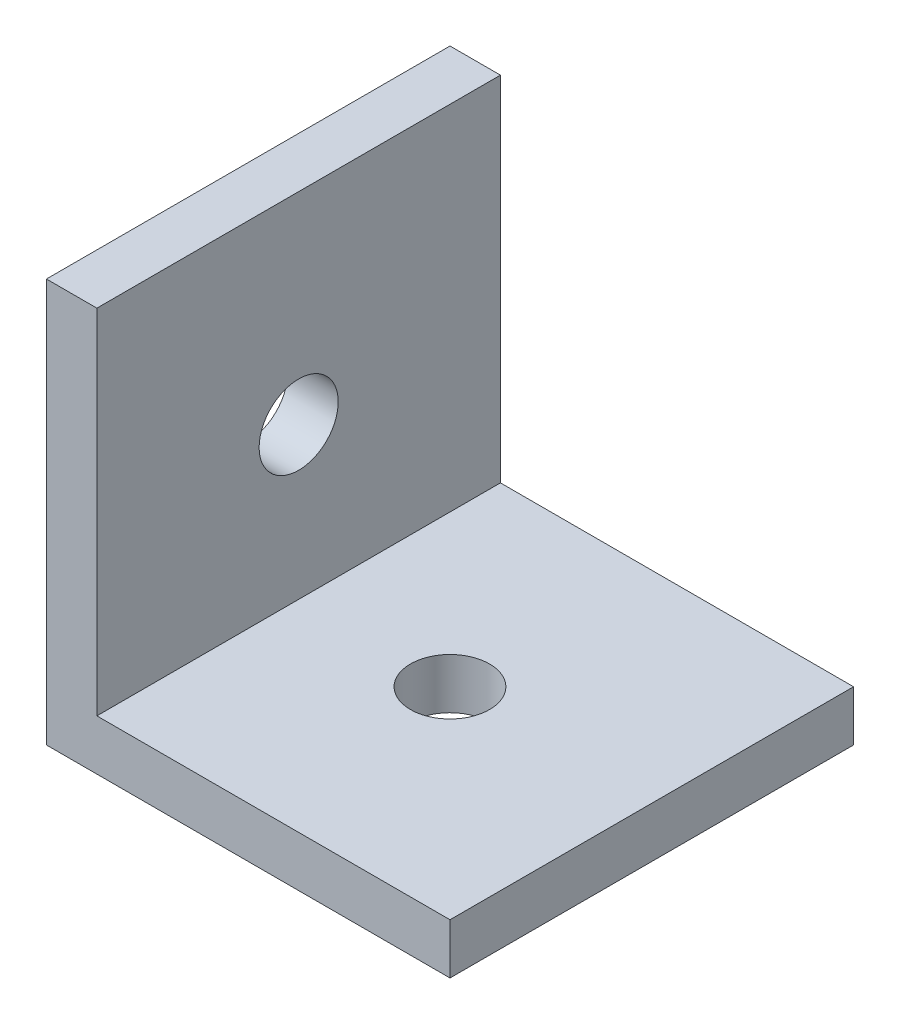
ISO-10303-21;
HEADER;
FILE_DESCRIPTION(('STEP AP214'),'2;1');
FILE_NAME('part.step','',(''),(''),'','','');
FILE_SCHEMA(('AUTOMOTIVE_DESIGN { 1 0 10303 214 1 1 1 1 }'));
ENDSEC;
DATA;
#1=APPLICATION_CONTEXT('core data for automotive mechanical design processes');
#2=APPLICATION_PROTOCOL_DEFINITION('international standard','automotive_design',2000,#1);
#3=PRODUCT_CONTEXT('',#1,'mechanical');
#4=PRODUCT('Part','Part','',(#3));
#5=PRODUCT_RELATED_PRODUCT_CATEGORY('part','',(#4));
#6=PRODUCT_DEFINITION_FORMATION('','',#4);
#7=PRODUCT_DEFINITION_CONTEXT('part definition',#1,'design');
#8=PRODUCT_DEFINITION('design','',#6,#7);
#9=PRODUCT_DEFINITION_SHAPE('','',#8);
#10=(LENGTH_UNIT() NAMED_UNIT(*) SI_UNIT(.MILLI.,.METRE.));
#11=(NAMED_UNIT(*) PLANE_ANGLE_UNIT() SI_UNIT($,.RADIAN.));
#12=(NAMED_UNIT(*) SI_UNIT($,.STERADIAN.) SOLID_ANGLE_UNIT());
#13=UNCERTAINTY_MEASURE_WITH_UNIT(LENGTH_MEASURE(1.E-05),#10,'distance_accuracy_value','');
#14=(GEOMETRIC_REPRESENTATION_CONTEXT(3) GLOBAL_UNCERTAINTY_ASSIGNED_CONTEXT((#13)) GLOBAL_UNIT_ASSIGNED_CONTEXT((#10,
#11,#12)) REPRESENTATION_CONTEXT('',''));
#15=CARTESIAN_POINT('',(0.,0.,0.));
#16=DIRECTION('',(0.,0.,1.));
#17=DIRECTION('',(1.,0.,0.));
#18=AXIS2_PLACEMENT_3D('',#15,#16,#17);
#19=CARTESIAN_POINT('',(0.,0.,12.7));
#20=DIRECTION('',(0.,1.,0.));
#21=DIRECTION('',(0.,0.,1.));
#22=AXIS2_PLACEMENT_3D('',#19,#20,#21);
#23=PLANE('',#22);
#24=CARTESIAN_POINT('',(12.7,0.,0.));
#25=DIRECTION('',(0.,1.,0.));
#26=DIRECTION('',(0.,0.,1.));
#27=AXIS2_PLACEMENT_3D('',#24,#25,#26);
#28=CIRCLE('',#27,2.4892);
#29=CARTESIAN_POINT('',(12.7,0.,2.4892));
#30=VERTEX_POINT('',#29);
#31=EDGE_CURVE('E130',#30,#30,#28,.T.);
#32=ORIENTED_EDGE('',*,*,#31,.T.);
#33=EDGE_LOOP('',(#32));
#34=FACE_BOUND('',#33,.T.);
#35=DIRECTION('',(1.,0.,0.));
#36=VECTOR('',#35,1.);
#37=CARTESIAN_POINT('',(0.,0.,-12.7));
#38=LINE('',#37,#36);
#39=CARTESIAN_POINT('',(0.,0.,-12.7));
#40=VERTEX_POINT('',#39);
#41=CARTESIAN_POINT('',(25.4,0.,-12.7));
#42=VERTEX_POINT('',#41);
#43=EDGE_CURVE('E125',#40,#42,#38,.T.);
#44=ORIENTED_EDGE('',*,*,#43,.T.);
#45=DIRECTION('',(0.,0.,-1.));
#46=VECTOR('',#45,1.);
#47=CARTESIAN_POINT('',(25.4,0.,12.7));
#48=LINE('',#47,#46);
#49=CARTESIAN_POINT('',(25.4,0.,12.7));
#50=VERTEX_POINT('',#49);
#51=EDGE_CURVE('E11',#50,#42,#48,.T.);
#52=ORIENTED_EDGE('',*,*,#51,.F.);
#53=DIRECTION('',(1.,0.,0.));
#54=VECTOR('',#53,1.);
#55=CARTESIAN_POINT('',(0.,0.,12.7));
#56=LINE('',#55,#54);
#57=CARTESIAN_POINT('',(0.,0.,12.7));
#58=VERTEX_POINT('',#57);
#59=EDGE_CURVE('E86',#58,#50,#56,.T.);
#60=ORIENTED_EDGE('',*,*,#59,.F.);
#61=DIRECTION('',(0.,0.,-1.));
#62=VECTOR('',#61,1.);
#63=CARTESIAN_POINT('',(0.,0.,12.7));
#64=LINE('',#63,#62);
#65=EDGE_CURVE('E121',#58,#40,#64,.T.);
#66=ORIENTED_EDGE('',*,*,#65,.T.);
#67=EDGE_LOOP('',(#44,#52,#60,#66));
#68=FACE_BOUND('',#67,.T.);
#69=ADVANCED_FACE('F39',(#34,#68),#23,.F.);
#70=CARTESIAN_POINT('',(25.4,3.175,12.7));
#71=DIRECTION('',(1.,0.,0.));
#72=DIRECTION('',(0.,0.,-1.));
#73=AXIS2_PLACEMENT_3D('',#70,#71,#72);
#74=PLANE('',#73);
#75=DIRECTION('',(0.,-1.,0.));
#76=VECTOR('',#75,1.);
#77=CARTESIAN_POINT('',(25.4,3.175,-12.7));
#78=LINE('',#77,#76);
#79=CARTESIAN_POINT('',(25.4,3.175,-12.7));
#80=VERTEX_POINT('',#79);
#81=EDGE_CURVE('E129',#80,#42,#78,.T.);
#82=ORIENTED_EDGE('',*,*,#81,.F.);
#83=DIRECTION('',(0.,0.,-1.));
#84=VECTOR('',#83,1.);
#85=CARTESIAN_POINT('',(25.4,3.175,12.7));
#86=LINE('',#85,#84);
#87=CARTESIAN_POINT('',(25.4,3.175,12.7));
#88=VERTEX_POINT('',#87);
#89=EDGE_CURVE('E48',#88,#80,#86,.T.);
#90=ORIENTED_EDGE('',*,*,#89,.F.);
#91=DIRECTION('',(0.,-1.,0.));
#92=VECTOR('',#91,1.);
#93=CARTESIAN_POINT('',(25.4,3.175,12.7));
#94=LINE('',#93,#92);
#95=EDGE_CURVE('E195',#88,#50,#94,.T.);
#96=ORIENTED_EDGE('',*,*,#95,.T.);
#97=ORIENTED_EDGE('',*,*,#51,.T.);
#98=EDGE_LOOP('',(#82,#90,#96,#97));
#99=FACE_BOUND('',#98,.T.);
#100=ADVANCED_FACE('F157',(#99),#74,.T.);
#101=CARTESIAN_POINT('',(0.,3.175,12.7));
#102=DIRECTION('',(0.,1.,0.));
#103=DIRECTION('',(0.,0.,1.));
#104=AXIS2_PLACEMENT_3D('',#101,#102,#103);
#105=PLANE('',#104);
#106=CARTESIAN_POINT('',(12.7,3.175,0.));
#107=DIRECTION('',(0.,1.,0.));
#108=DIRECTION('',(0.,0.,1.));
#109=AXIS2_PLACEMENT_3D('',#106,#107,#108);
#110=CIRCLE('',#109,2.4892);
#111=CARTESIAN_POINT('',(12.7,3.175,2.4892));
#112=VERTEX_POINT('',#111);
#113=EDGE_CURVE('E183',#112,#112,#110,.T.);
#114=ORIENTED_EDGE('',*,*,#113,.F.);
#115=EDGE_LOOP('',(#114));
#116=FACE_BOUND('',#115,.T.);
#117=DIRECTION('',(1.,0.,0.));
#118=VECTOR('',#117,1.);
#119=CARTESIAN_POINT('',(0.,3.175,-12.7));
#120=LINE('',#119,#118);
#121=CARTESIAN_POINT('',(3.175,3.175,-12.7));
#122=VERTEX_POINT('',#121);
#123=EDGE_CURVE('E134',#122,#80,#120,.T.);
#124=ORIENTED_EDGE('',*,*,#123,.F.);
#125=DIRECTION('',(0.,0.,-1.));
#126=VECTOR('',#125,1.);
#127=CARTESIAN_POINT('',(3.175,3.175,12.7));
#128=LINE('',#127,#126);
#129=CARTESIAN_POINT('',(3.175,3.175,12.7));
#130=VERTEX_POINT('',#129);
#131=EDGE_CURVE('E108',#130,#122,#128,.T.);
#132=ORIENTED_EDGE('',*,*,#131,.F.);
#133=DIRECTION('',(1.,0.,0.));
#134=VECTOR('',#133,1.);
#135=CARTESIAN_POINT('',(0.,3.175,12.7));
#136=LINE('',#135,#134);
#137=EDGE_CURVE('E114',#130,#88,#136,.T.);
#138=ORIENTED_EDGE('',*,*,#137,.T.);
#139=ORIENTED_EDGE('',*,*,#89,.T.);
#140=EDGE_LOOP('',(#124,#132,#138,#139));
#141=FACE_BOUND('',#140,.T.);
#142=ADVANCED_FACE('F154',(#116,#141),#105,.T.);
#143=CARTESIAN_POINT('',(3.175,25.4,12.7));
#144=DIRECTION('',(1.,0.,0.));
#145=DIRECTION('',(0.,0.,-1.));
#146=AXIS2_PLACEMENT_3D('',#143,#144,#145);
#147=PLANE('',#146);
#148=CARTESIAN_POINT('',(3.175,12.7,0.));
#149=DIRECTION('',(-1.,0.,0.));
#150=DIRECTION('',(0.,0.,1.));
#151=AXIS2_PLACEMENT_3D('',#148,#149,#150);
#152=CIRCLE('',#151,2.4892);
#153=CARTESIAN_POINT('',(3.175,12.7,2.4892));
#154=VERTEX_POINT('',#153);
#155=EDGE_CURVE('E190',#154,#154,#152,.T.);
#156=ORIENTED_EDGE('',*,*,#155,.T.);
#157=EDGE_LOOP('',(#156));
#158=FACE_BOUND('',#157,.T.);
#159=DIRECTION('',(0.,1.,0.));
#160=VECTOR('',#159,1.);
#161=CARTESIAN_POINT('',(3.175,25.4,-12.7));
#162=LINE('',#161,#160);
#163=CARTESIAN_POINT('',(3.175,25.4,-12.7));
#164=VERTEX_POINT('',#163);
#165=EDGE_CURVE('E102',#164,#122,#162,.F.);
#166=ORIENTED_EDGE('',*,*,#165,.F.);
#167=DIRECTION('',(0.,0.,-1.));
#168=VECTOR('',#167,1.);
#169=CARTESIAN_POINT('',(3.175,25.4,12.7));
#170=LINE('',#169,#168);
#171=CARTESIAN_POINT('',(3.175,25.4,12.7));
#172=VERTEX_POINT('',#171);
#173=EDGE_CURVE('E97',#172,#164,#170,.T.);
#174=ORIENTED_EDGE('',*,*,#173,.F.);
#175=DIRECTION('',(0.,1.,0.));
#176=VECTOR('',#175,1.);
#177=CARTESIAN_POINT('',(3.175,25.4,12.7));
#178=LINE('',#177,#176);
#179=EDGE_CURVE('E100',#172,#130,#178,.F.);
#180=ORIENTED_EDGE('',*,*,#179,.T.);
#181=ORIENTED_EDGE('',*,*,#131,.T.);
#182=EDGE_LOOP('',(#166,#174,#180,#181));
#183=FACE_BOUND('',#182,.T.);
#184=ADVANCED_FACE('F99',(#158,#183),#147,.T.);
#185=CARTESIAN_POINT('',(0.,25.4,12.7));
#186=DIRECTION('',(0.,1.,0.));
#187=DIRECTION('',(0.,0.,1.));
#188=AXIS2_PLACEMENT_3D('',#185,#186,#187);
#189=PLANE('',#188);
#190=DIRECTION('',(1.,0.,0.));
#191=VECTOR('',#190,1.);
#192=CARTESIAN_POINT('',(0.,25.4,-12.7));
#193=LINE('',#192,#191);
#194=CARTESIAN_POINT('',(0.,25.4,-12.7));
#195=VERTEX_POINT('',#194);
#196=EDGE_CURVE('E140',#195,#164,#193,.T.);
#197=ORIENTED_EDGE('',*,*,#196,.F.);
#198=DIRECTION('',(0.,0.,-1.));
#199=VECTOR('',#198,1.);
#200=CARTESIAN_POINT('',(0.,25.4,12.7));
#201=LINE('',#200,#199);
#202=CARTESIAN_POINT('',(0.,25.4,12.7));
#203=VERTEX_POINT('',#202);
#204=EDGE_CURVE('E77',#203,#195,#201,.T.);
#205=ORIENTED_EDGE('',*,*,#204,.F.);
#206=DIRECTION('',(1.,0.,0.));
#207=VECTOR('',#206,1.);
#208=CARTESIAN_POINT('',(0.,25.4,12.7));
#209=LINE('',#208,#207);
#210=EDGE_CURVE('E112',#203,#172,#209,.T.);
#211=ORIENTED_EDGE('',*,*,#210,.T.);
#212=ORIENTED_EDGE('',*,*,#173,.T.);
#213=EDGE_LOOP('',(#197,#205,#211,#212));
#214=FACE_BOUND('',#213,.T.);
#215=ADVANCED_FACE('F117',(#214),#189,.T.);
#216=CARTESIAN_POINT('',(0.,25.4,12.7));
#217=DIRECTION('',(1.,0.,0.));
#218=DIRECTION('',(0.,0.,-1.));
#219=AXIS2_PLACEMENT_3D('',#216,#217,#218);
#220=PLANE('',#219);
#221=CARTESIAN_POINT('',(0.,12.7,0.));
#222=DIRECTION('',(-1.,0.,0.));
#223=DIRECTION('',(0.,0.,1.));
#224=AXIS2_PLACEMENT_3D('',#221,#222,#223);
#225=CIRCLE('',#224,2.4892);
#226=CARTESIAN_POINT('',(0.,12.7,2.4892));
#227=VERTEX_POINT('',#226);
#228=EDGE_CURVE('E187',#227,#227,#225,.T.);
#229=ORIENTED_EDGE('',*,*,#228,.F.);
#230=EDGE_LOOP('',(#229));
#231=FACE_BOUND('',#230,.T.);
#232=DIRECTION('',(0.,-1.,0.));
#233=VECTOR('',#232,1.);
#234=CARTESIAN_POINT('',(0.,25.4,-12.7));
#235=LINE('',#234,#233);
#236=EDGE_CURVE('E80',#195,#40,#235,.T.);
#237=ORIENTED_EDGE('',*,*,#236,.T.);
#238=ORIENTED_EDGE('',*,*,#65,.F.);
#239=DIRECTION('',(0.,-1.,0.));
#240=VECTOR('',#239,1.);
#241=CARTESIAN_POINT('',(0.,25.4,12.7));
#242=LINE('',#241,#240);
#243=EDGE_CURVE('E56',#203,#58,#242,.T.);
#244=ORIENTED_EDGE('',*,*,#243,.F.);
#245=ORIENTED_EDGE('',*,*,#204,.T.);
#246=EDGE_LOOP('',(#237,#238,#244,#245));
#247=FACE_BOUND('',#246,.T.);
#248=ADVANCED_FACE('F162',(#231,#247),#220,.F.);
#249=CARTESIAN_POINT('',(0.,0.,12.7));
#250=DIRECTION('',(0.,0.,-1.));
#251=DIRECTION('',(-1.,0.,0.));
#252=AXIS2_PLACEMENT_3D('',#249,#250,#251);
#253=PLANE('',#252);
#254=ORIENTED_EDGE('',*,*,#59,.T.);
#255=ORIENTED_EDGE('',*,*,#95,.F.);
#256=ORIENTED_EDGE('',*,*,#137,.F.);
#257=ORIENTED_EDGE('',*,*,#179,.F.);
#258=ORIENTED_EDGE('',*,*,#210,.F.);
#259=ORIENTED_EDGE('',*,*,#243,.T.);
#260=EDGE_LOOP('',(#254,#255,#256,#257,#258,#259));
#261=FACE_BOUND('',#260,.T.);
#262=ADVANCED_FACE('F111',(#261),#253,.F.);
#263=CARTESIAN_POINT('',(0.,0.,-12.7));
#264=DIRECTION('',(0.,0.,-1.));
#265=DIRECTION('',(-1.,0.,0.));
#266=AXIS2_PLACEMENT_3D('',#263,#264,#265);
#267=PLANE('',#266);
#268=ORIENTED_EDGE('',*,*,#43,.F.);
#269=ORIENTED_EDGE('',*,*,#236,.F.);
#270=ORIENTED_EDGE('',*,*,#196,.T.);
#271=ORIENTED_EDGE('',*,*,#165,.T.);
#272=ORIENTED_EDGE('',*,*,#123,.T.);
#273=ORIENTED_EDGE('',*,*,#81,.T.);
#274=EDGE_LOOP('',(#268,#269,#270,#271,#272,#273));
#275=FACE_BOUND('',#274,.T.);
#276=ADVANCED_FACE('F160',(#275),#267,.T.);
#277=CARTESIAN_POINT('',(12.7,0.,0.));
#278=DIRECTION('',(0.,1.,0.));
#279=DIRECTION('',(0.,0.,1.));
#280=AXIS2_PLACEMENT_3D('',#277,#278,#279);
#281=CYLINDRICAL_SURFACE('',#280,2.4892);
#282=ORIENTED_EDGE('',*,*,#31,.F.);
#283=EDGE_LOOP('',(#282));
#284=FACE_BOUND('',#283,.T.);
#285=ORIENTED_EDGE('',*,*,#113,.T.);
#286=EDGE_LOOP('',(#285));
#287=FACE_BOUND('',#286,.T.);
#288=ADVANCED_FACE('F206',(#284,#287),#281,.F.);
#289=CARTESIAN_POINT('',(0.,12.7,0.));
#290=DIRECTION('',(1.,0.,0.));
#291=DIRECTION('',(0.,1.,0.));
#292=AXIS2_PLACEMENT_3D('',#289,#290,#291);
#293=CYLINDRICAL_SURFACE('',#292,2.4892);
#294=ORIENTED_EDGE('',*,*,#228,.T.);
#295=EDGE_LOOP('',(#294));
#296=FACE_BOUND('',#295,.T.);
#297=ORIENTED_EDGE('',*,*,#155,.F.);
#298=EDGE_LOOP('',(#297));
#299=FACE_BOUND('',#298,.T.);
#300=ADVANCED_FACE('F203',(#296,#299),#293,.F.);
#301=CLOSED_SHELL('',(#69,#100,#142,#184,#215,#248,#262,#276,#288,#300));
#302=MANIFOLD_SOLID_BREP('B2',#301);
#303=ADVANCED_BREP_SHAPE_REPRESENTATION('',(#18,#302),#14);
#304=SHAPE_DEFINITION_REPRESENTATION(#9,#303);
ENDSEC;
END-ISO-10303-21;
